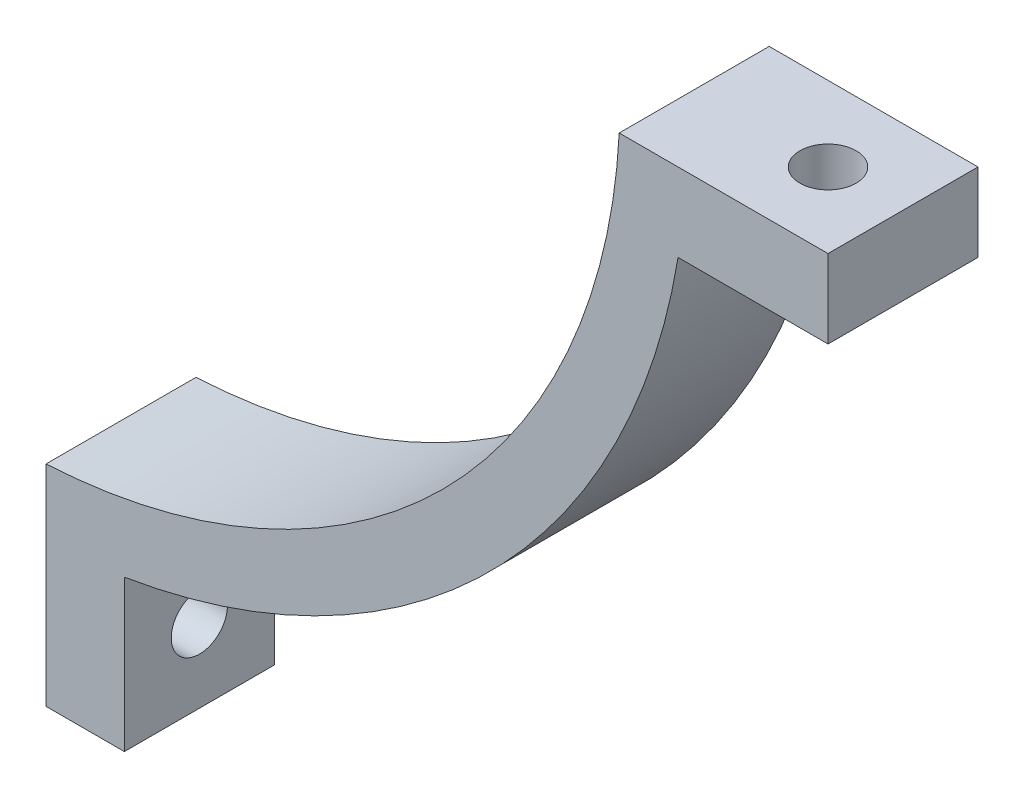
ISO-10303-21;
HEADER;
FILE_DESCRIPTION(('STEP AP214'),'2;1');
FILE_NAME('part.step','',(''),(''),'','','');
FILE_SCHEMA(('AUTOMOTIVE_DESIGN { 1 0 10303 214 1 1 1 1 }'));
ENDSEC;
DATA;
#1=APPLICATION_CONTEXT('core data for automotive mechanical design processes');
#2=APPLICATION_PROTOCOL_DEFINITION('international standard','automotive_design',2000,#1);
#3=PRODUCT_CONTEXT('',#1,'mechanical');
#4=PRODUCT('Part','Part','',(#3));
#5=PRODUCT_RELATED_PRODUCT_CATEGORY('part','',(#4));
#6=PRODUCT_DEFINITION_FORMATION('','',#4);
#7=PRODUCT_DEFINITION_CONTEXT('part definition',#1,'design');
#8=PRODUCT_DEFINITION('design','',#6,#7);
#9=PRODUCT_DEFINITION_SHAPE('','',#8);
#10=(LENGTH_UNIT() NAMED_UNIT(*) SI_UNIT(.MILLI.,.METRE.));
#11=(NAMED_UNIT(*) PLANE_ANGLE_UNIT() SI_UNIT($,.RADIAN.));
#12=(NAMED_UNIT(*) SI_UNIT($,.STERADIAN.) SOLID_ANGLE_UNIT());
#13=UNCERTAINTY_MEASURE_WITH_UNIT(LENGTH_MEASURE(1.E-05),#10,'distance_accuracy_value','');
#14=(GEOMETRIC_REPRESENTATION_CONTEXT(3) GLOBAL_UNCERTAINTY_ASSIGNED_CONTEXT((#13)) GLOBAL_UNIT_ASSIGNED_CONTEXT((#10,
#11,#12)) REPRESENTATION_CONTEXT('',''));
#15=CARTESIAN_POINT('',(0.,0.,0.));
#16=DIRECTION('',(0.,0.,1.));
#17=DIRECTION('',(1.,0.,0.));
#18=AXIS2_PLACEMENT_3D('',#15,#16,#17);
#19=CARTESIAN_POINT('',(0.,0.,12.7));
#20=DIRECTION('',(0.,0.,-1.));
#21=DIRECTION('',(-1.,0.,0.));
#22=AXIS2_PLACEMENT_3D('',#19,#20,#21);
#23=CYLINDRICAL_SURFACE('',#22,51.2439582188837);
#24=CARTESIAN_POINT('',(0.,0.,0.));
#25=DIRECTION('',(0.,0.,-1.));
#26=DIRECTION('',(-1.,0.,0.));
#27=AXIS2_PLACEMENT_3D('',#24,#25,#26);
#28=CIRCLE('',#27,51.2439582188837);
#29=CARTESIAN_POINT('',(51.1761537376169,-2.63525000000002,0.));
#30=VERTEX_POINT('',#29);
#31=CARTESIAN_POINT('',(2.63524999999997,-51.1761537376169,0.));
#32=VERTEX_POINT('',#31);
#33=EDGE_CURVE('E146',#30,#32,#28,.T.);
#34=ORIENTED_EDGE('',*,*,#33,.T.);
#35=DIRECTION('',(0.,0.,-1.));
#36=VECTOR('',#35,1.);
#37=CARTESIAN_POINT('',(2.63524999999997,-51.1761537376169,12.7));
#38=LINE('',#37,#36);
#39=CARTESIAN_POINT('',(2.63524999999997,-51.1761537376169,12.7));
#40=VERTEX_POINT('',#39);
#41=EDGE_CURVE('E11',#40,#32,#38,.T.);
#42=ORIENTED_EDGE('',*,*,#41,.F.);
#43=CARTESIAN_POINT('',(0.,0.,12.7));
#44=DIRECTION('',(0.,0.,-1.));
#45=DIRECTION('',(-1.,0.,0.));
#46=AXIS2_PLACEMENT_3D('',#43,#44,#45);
#47=CIRCLE('',#46,51.2439582188837);
#48=CARTESIAN_POINT('',(51.1761537376169,-2.63525000000002,12.7));
#49=VERTEX_POINT('',#48);
#50=EDGE_CURVE('E169',#49,#40,#47,.T.);
#51=ORIENTED_EDGE('',*,*,#50,.F.);
#52=DIRECTION('',(0.,0.,-1.));
#53=VECTOR('',#52,1.);
#54=CARTESIAN_POINT('',(51.1761537376169,-2.63525000000002,12.7));
#55=LINE('',#54,#53);
#56=EDGE_CURVE('E142',#49,#30,#55,.T.);
#57=ORIENTED_EDGE('',*,*,#56,.T.);
#58=EDGE_LOOP('',(#34,#42,#51,#57));
#59=FACE_BOUND('',#58,.T.);
#60=ADVANCED_FACE('F45',(#59),#23,.F.);
#61=CARTESIAN_POINT('',(2.63524999999997,-51.1761537376169,12.7));
#62=DIRECTION('',(1.,0.,0.));
#63=DIRECTION('',(0.,1.,0.));
#64=AXIS2_PLACEMENT_3D('',#61,#62,#63);
#65=PLANE('',#64);
#66=CARTESIAN_POINT('',(2.63524999999997,-62.6061537376169,6.35));
#67=DIRECTION('',(1.,0.,0.));
#68=DIRECTION('',(0.,0.,-1.));
#69=AXIS2_PLACEMENT_3D('',#66,#67,#68);
#70=CIRCLE('',#69,2.38125);
#71=CARTESIAN_POINT('',(2.63524999999997,-62.6061537376169,3.96875));
#72=VERTEX_POINT('',#71);
#73=EDGE_CURVE('E151',#72,#72,#70,.T.);
#74=ORIENTED_EDGE('',*,*,#73,.T.);
#75=EDGE_LOOP('',(#74));
#76=FACE_BOUND('',#75,.T.);
#77=DIRECTION('',(0.,-1.,0.));
#78=VECTOR('',#77,1.);
#79=CARTESIAN_POINT('',(2.63524999999997,-51.1761537376169,0.));
#80=LINE('',#79,#78);
#81=CARTESIAN_POINT('',(2.63524999999997,-68.9561537376169,0.));
#82=VERTEX_POINT('',#81);
#83=EDGE_CURVE('E150',#32,#82,#80,.T.);
#84=ORIENTED_EDGE('',*,*,#83,.T.);
#85=DIRECTION('',(0.,0.,-1.));
#86=VECTOR('',#85,1.);
#87=CARTESIAN_POINT('',(2.63524999999997,-68.9561537376169,12.7));
#88=LINE('',#87,#86);
#89=CARTESIAN_POINT('',(2.63524999999997,-68.9561537376169,12.7));
#90=VERTEX_POINT('',#89);
#91=EDGE_CURVE('E54',#90,#82,#88,.T.);
#92=ORIENTED_EDGE('',*,*,#91,.F.);
#93=DIRECTION('',(0.,-1.,0.));
#94=VECTOR('',#93,1.);
#95=CARTESIAN_POINT('',(2.63524999999997,-51.1761537376169,12.7));
#96=LINE('',#95,#94);
#97=EDGE_CURVE('E105',#40,#90,#96,.T.);
#98=ORIENTED_EDGE('',*,*,#97,.F.);
#99=ORIENTED_EDGE('',*,*,#41,.T.);
#100=EDGE_LOOP('',(#84,#92,#98,#99));
#101=FACE_BOUND('',#100,.T.);
#102=ADVANCED_FACE('F249',(#76,#101),#65,.F.);
#103=CARTESIAN_POINT('',(2.63524999999997,-68.9561537376169,12.7));
#104=DIRECTION('',(0.,1.,0.));
#105=DIRECTION('',(-1.,0.,0.));
#106=AXIS2_PLACEMENT_3D('',#103,#104,#105);
#107=PLANE('',#106);
#108=DIRECTION('',(1.,0.,0.));
#109=VECTOR('',#108,1.);
#110=CARTESIAN_POINT('',(2.63524999999997,-68.9561537376169,0.));
#111=LINE('',#110,#109);
#112=CARTESIAN_POINT('',(9.27099999999988,-68.9561537376169,0.));
#113=VERTEX_POINT('',#112);
#114=EDGE_CURVE('E154',#82,#113,#111,.T.);
#115=ORIENTED_EDGE('',*,*,#114,.T.);
#116=DIRECTION('',(0.,0.,-1.));
#117=VECTOR('',#116,1.);
#118=CARTESIAN_POINT('',(9.27099999999988,-68.9561537376169,12.7));
#119=LINE('',#118,#117);
#120=CARTESIAN_POINT('',(9.27099999999988,-68.9561537376169,12.7));
#121=VERTEX_POINT('',#120);
#122=EDGE_CURVE('E180',#121,#113,#119,.T.);
#123=ORIENTED_EDGE('',*,*,#122,.F.);
#124=DIRECTION('',(1.,0.,0.));
#125=VECTOR('',#124,1.);
#126=CARTESIAN_POINT('',(2.63524999999997,-68.9561537376169,12.7));
#127=LINE('',#126,#125);
#128=EDGE_CURVE('E190',#90,#121,#127,.T.);
#129=ORIENTED_EDGE('',*,*,#128,.F.);
#130=ORIENTED_EDGE('',*,*,#91,.T.);
#131=EDGE_LOOP('',(#115,#123,#129,#130));
#132=FACE_BOUND('',#131,.T.);
#133=ADVANCED_FACE('F188',(#132),#107,.F.);
#134=CARTESIAN_POINT('',(9.27099999999988,-68.9561537376169,12.7));
#135=DIRECTION('',(-1.,0.,0.));
#136=DIRECTION('',(0.,-1.,0.));
#137=AXIS2_PLACEMENT_3D('',#134,#135,#136);
#138=PLANE('',#137);
#139=CARTESIAN_POINT('',(9.27099999999987,-62.6061537376169,6.35));
#140=DIRECTION('',(1.,0.,0.));
#141=DIRECTION('',(0.,0.,-1.));
#142=AXIS2_PLACEMENT_3D('',#139,#140,#141);
#143=CIRCLE('',#142,2.38125);
#144=CARTESIAN_POINT('',(9.27099999999987,-62.6061537376169,3.96875));
#145=VERTEX_POINT('',#144);
#146=EDGE_CURVE('E213',#145,#145,#143,.T.);
#147=ORIENTED_EDGE('',*,*,#146,.F.);
#148=EDGE_LOOP('',(#147));
#149=FACE_BOUND('',#148,.T.);
#150=DIRECTION('',(0.,1.,0.));
#151=VECTOR('',#150,1.);
#152=CARTESIAN_POINT('',(9.27099999999988,-68.9561537376169,0.));
#153=LINE('',#152,#151);
#154=CARTESIAN_POINT('',(9.2709999999999,-56.1595459768018,0.));
#155=VERTEX_POINT('',#154);
#156=EDGE_CURVE('E157',#113,#155,#153,.T.);
#157=ORIENTED_EDGE('',*,*,#156,.T.);
#158=DIRECTION('',(0.,0.,-1.));
#159=VECTOR('',#158,1.);
#160=CARTESIAN_POINT('',(9.2709999999999,-56.1595459768018,12.7));
#161=LINE('',#160,#159);
#162=CARTESIAN_POINT('',(9.2709999999999,-56.1595459768018,12.7));
#163=VERTEX_POINT('',#162);
#164=EDGE_CURVE('E176',#163,#155,#161,.T.);
#165=ORIENTED_EDGE('',*,*,#164,.F.);
#166=DIRECTION('',(0.,1.,0.));
#167=VECTOR('',#166,1.);
#168=CARTESIAN_POINT('',(9.27099999999988,-68.9561537376169,12.7));
#169=LINE('',#168,#167);
#170=EDGE_CURVE('E203',#121,#163,#169,.T.);
#171=ORIENTED_EDGE('',*,*,#170,.F.);
#172=ORIENTED_EDGE('',*,*,#122,.T.);
#173=EDGE_LOOP('',(#157,#165,#171,#172));
#174=FACE_BOUND('',#173,.T.);
#175=ADVANCED_FACE('F198',(#149,#174),#138,.F.);
#176=CARTESIAN_POINT('',(0.,0.,12.7));
#177=DIRECTION('',(0.,0.,-1.));
#178=DIRECTION('',(-1.,0.,0.));
#179=AXIS2_PLACEMENT_3D('',#176,#177,#178);
#180=CYLINDRICAL_SURFACE('',#179,56.9196455129555);
#181=CARTESIAN_POINT('',(0.,0.,0.));
#182=DIRECTION('',(0.,0.,1.));
#183=DIRECTION('',(-1.,0.,0.));
#184=AXIS2_PLACEMENT_3D('',#181,#182,#183);
#185=CIRCLE('',#184,56.9196455129555);
#186=CARTESIAN_POINT('',(56.1595459768018,-9.27099999999999,0.));
#187=VERTEX_POINT('',#186);
#188=EDGE_CURVE('E160',#155,#187,#185,.T.);
#189=ORIENTED_EDGE('',*,*,#188,.T.);
#190=DIRECTION('',(0.,0.,-1.));
#191=VECTOR('',#190,1.);
#192=CARTESIAN_POINT('',(56.1595459768018,-9.27099999999999,12.7));
#193=LINE('',#192,#191);
#194=CARTESIAN_POINT('',(56.1595459768018,-9.27099999999999,12.7));
#195=VERTEX_POINT('',#194);
#196=EDGE_CURVE('E135',#195,#187,#193,.T.);
#197=ORIENTED_EDGE('',*,*,#196,.F.);
#198=CARTESIAN_POINT('',(0.,0.,12.7));
#199=DIRECTION('',(0.,0.,1.));
#200=DIRECTION('',(-1.,0.,0.));
#201=AXIS2_PLACEMENT_3D('',#198,#199,#200);
#202=CIRCLE('',#201,56.9196455129555);
#203=EDGE_CURVE('E124',#163,#195,#202,.T.);
#204=ORIENTED_EDGE('',*,*,#203,.F.);
#205=ORIENTED_EDGE('',*,*,#164,.T.);
#206=EDGE_LOOP('',(#189,#197,#204,#205));
#207=FACE_BOUND('',#206,.T.);
#208=ADVANCED_FACE('F201',(#207),#180,.T.);
#209=CARTESIAN_POINT('',(68.8595459768018,-9.27099999999999,12.7));
#210=DIRECTION('',(0.,1.,0.));
#211=DIRECTION('',(0.,0.,1.));
#212=AXIS2_PLACEMENT_3D('',#209,#210,#211);
#213=PLANE('',#212);
#214=CARTESIAN_POINT('',(62.5095459768018,-9.27099999999999,6.35));
#215=DIRECTION('',(0.,-1.,0.));
#216=DIRECTION('',(0.,0.,-1.));
#217=AXIS2_PLACEMENT_3D('',#214,#215,#216);
#218=CIRCLE('',#217,2.38125000000001);
#219=CARTESIAN_POINT('',(62.5095459768018,-9.27099999999999,3.96874999999999));
#220=VERTEX_POINT('',#219);
#221=EDGE_CURVE('E221',#220,#220,#218,.T.);
#222=ORIENTED_EDGE('',*,*,#221,.F.);
#223=EDGE_LOOP('',(#222));
#224=FACE_BOUND('',#223,.T.);
#225=DIRECTION('',(1.,0.,0.));
#226=VECTOR('',#225,1.);
#227=CARTESIAN_POINT('',(68.8595459768018,-9.27099999999999,0.));
#228=LINE('',#227,#226);
#229=CARTESIAN_POINT('',(68.8595459768018,-9.27099999999999,0.));
#230=VERTEX_POINT('',#229);
#231=EDGE_CURVE('E133',#187,#230,#228,.T.);
#232=ORIENTED_EDGE('',*,*,#231,.T.);
#233=DIRECTION('',(0.,0.,-1.));
#234=VECTOR('',#233,1.);
#235=CARTESIAN_POINT('',(68.8595459768018,-9.27099999999999,12.7));
#236=LINE('',#235,#234);
#237=CARTESIAN_POINT('',(68.8595459768018,-9.27099999999999,12.7));
#238=VERTEX_POINT('',#237);
#239=EDGE_CURVE('E130',#238,#230,#236,.T.);
#240=ORIENTED_EDGE('',*,*,#239,.F.);
#241=DIRECTION('',(1.,0.,0.));
#242=VECTOR('',#241,1.);
#243=CARTESIAN_POINT('',(68.8595459768018,-9.27099999999999,12.7));
#244=LINE('',#243,#242);
#245=EDGE_CURVE('E118',#195,#238,#244,.T.);
#246=ORIENTED_EDGE('',*,*,#245,.F.);
#247=ORIENTED_EDGE('',*,*,#196,.T.);
#248=EDGE_LOOP('',(#232,#240,#246,#247));
#249=FACE_BOUND('',#248,.T.);
#250=ADVANCED_FACE('F131',(#224,#249),#213,.F.);
#251=CARTESIAN_POINT('',(68.8595459768018,-2.63525000000002,12.7));
#252=DIRECTION('',(-1.,0.,0.));
#253=DIRECTION('',(0.,0.,1.));
#254=AXIS2_PLACEMENT_3D('',#251,#252,#253);
#255=PLANE('',#254);
#256=DIRECTION('',(0.,1.,0.));
#257=VECTOR('',#256,1.);
#258=CARTESIAN_POINT('',(68.8595459768018,-2.63525000000002,0.));
#259=LINE('',#258,#257);
#260=CARTESIAN_POINT('',(68.8595459768018,-2.63525000000002,0.));
#261=VERTEX_POINT('',#260);
#262=EDGE_CURVE('E91',#230,#261,#259,.T.);
#263=ORIENTED_EDGE('',*,*,#262,.T.);
#264=DIRECTION('',(0.,0.,-1.));
#265=VECTOR('',#264,1.);
#266=CARTESIAN_POINT('',(68.8595459768018,-2.63525000000002,12.7));
#267=LINE('',#266,#265);
#268=CARTESIAN_POINT('',(68.8595459768018,-2.63525000000002,12.7));
#269=VERTEX_POINT('',#268);
#270=EDGE_CURVE('E136',#269,#261,#267,.T.);
#271=ORIENTED_EDGE('',*,*,#270,.F.);
#272=DIRECTION('',(0.,1.,0.));
#273=VECTOR('',#272,1.);
#274=CARTESIAN_POINT('',(68.8595459768018,-2.63525000000002,12.7));
#275=LINE('',#274,#273);
#276=EDGE_CURVE('E122',#238,#269,#275,.T.);
#277=ORIENTED_EDGE('',*,*,#276,.F.);
#278=ORIENTED_EDGE('',*,*,#239,.T.);
#279=EDGE_LOOP('',(#263,#271,#277,#278));
#280=FACE_BOUND('',#279,.T.);
#281=ADVANCED_FACE('F138',(#280),#255,.F.);
#282=CARTESIAN_POINT('',(51.1761537376169,-2.63525000000002,12.7));
#283=DIRECTION('',(0.,-1.,0.));
#284=DIRECTION('',(1.,0.,0.));
#285=AXIS2_PLACEMENT_3D('',#282,#283,#284);
#286=PLANE('',#285);
#287=CARTESIAN_POINT('',(62.5095459768018,-2.63525000000002,6.35));
#288=DIRECTION('',(0.,-1.,0.));
#289=DIRECTION('',(0.,0.,-1.));
#290=AXIS2_PLACEMENT_3D('',#287,#288,#289);
#291=CIRCLE('',#290,2.38125000000001);
#292=CARTESIAN_POINT('',(62.5095459768018,-2.63525000000002,3.96874999999999));
#293=VERTEX_POINT('',#292);
#294=EDGE_CURVE('E217',#293,#293,#291,.T.);
#295=ORIENTED_EDGE('',*,*,#294,.T.);
#296=EDGE_LOOP('',(#295));
#297=FACE_BOUND('',#296,.T.);
#298=DIRECTION('',(-1.,0.,0.));
#299=VECTOR('',#298,1.);
#300=CARTESIAN_POINT('',(51.1761537376169,-2.63525000000002,0.));
#301=LINE('',#300,#299);
#302=EDGE_CURVE('E97',#261,#30,#301,.T.);
#303=ORIENTED_EDGE('',*,*,#302,.T.);
#304=ORIENTED_EDGE('',*,*,#56,.F.);
#305=DIRECTION('',(-1.,0.,0.));
#306=VECTOR('',#305,1.);
#307=CARTESIAN_POINT('',(51.1761537376169,-2.63525000000002,12.7));
#308=LINE('',#307,#306);
#309=EDGE_CURVE('E62',#269,#49,#308,.T.);
#310=ORIENTED_EDGE('',*,*,#309,.F.);
#311=ORIENTED_EDGE('',*,*,#270,.T.);
#312=EDGE_LOOP('',(#303,#304,#310,#311));
#313=FACE_BOUND('',#312,.T.);
#314=ADVANCED_FACE('F229',(#297,#313),#286,.F.);
#315=CARTESIAN_POINT('',(0.,0.,12.7));
#316=DIRECTION('',(0.,0.,-1.));
#317=DIRECTION('',(-1.,0.,0.));
#318=AXIS2_PLACEMENT_3D('',#315,#316,#317);
#319=PLANE('',#318);
#320=ORIENTED_EDGE('',*,*,#50,.T.);
#321=ORIENTED_EDGE('',*,*,#97,.T.);
#322=ORIENTED_EDGE('',*,*,#128,.T.);
#323=ORIENTED_EDGE('',*,*,#170,.T.);
#324=ORIENTED_EDGE('',*,*,#203,.T.);
#325=ORIENTED_EDGE('',*,*,#245,.T.);
#326=ORIENTED_EDGE('',*,*,#276,.T.);
#327=ORIENTED_EDGE('',*,*,#309,.T.);
#328=EDGE_LOOP('',(#320,#321,#322,#323,#324,#325,#326,#327));
#329=FACE_BOUND('',#328,.T.);
#330=ADVANCED_FACE('F120',(#329),#319,.F.);
#331=CARTESIAN_POINT('',(0.,0.,0.));
#332=DIRECTION('',(0.,0.,-1.));
#333=DIRECTION('',(-1.,0.,0.));
#334=AXIS2_PLACEMENT_3D('',#331,#332,#333);
#335=PLANE('',#334);
#336=ORIENTED_EDGE('',*,*,#33,.F.);
#337=ORIENTED_EDGE('',*,*,#302,.F.);
#338=ORIENTED_EDGE('',*,*,#262,.F.);
#339=ORIENTED_EDGE('',*,*,#231,.F.);
#340=ORIENTED_EDGE('',*,*,#188,.F.);
#341=ORIENTED_EDGE('',*,*,#156,.F.);
#342=ORIENTED_EDGE('',*,*,#114,.F.);
#343=ORIENTED_EDGE('',*,*,#83,.F.);
#344=EDGE_LOOP('',(#336,#337,#338,#339,#340,#341,#342,#343));
#345=FACE_BOUND('',#344,.T.);
#346=ADVANCED_FACE('F194',(#345),#335,.T.);
#347=CARTESIAN_POINT('',(2.63524999999997,-62.6061537376169,6.35));
#348=DIRECTION('',(1.,0.,0.));
#349=DIRECTION('',(0.,0.,-1.));
#350=AXIS2_PLACEMENT_3D('',#347,#348,#349);
#351=CYLINDRICAL_SURFACE('',#350,2.38125);
#352=ORIENTED_EDGE('',*,*,#73,.F.);
#353=EDGE_LOOP('',(#352));
#354=FACE_BOUND('',#353,.T.);
#355=ORIENTED_EDGE('',*,*,#146,.T.);
#356=EDGE_LOOP('',(#355));
#357=FACE_BOUND('',#356,.T.);
#358=ADVANCED_FACE('F234',(#354,#357),#351,.F.);
#359=CARTESIAN_POINT('',(62.5095459768018,-2.63525000000002,6.35));
#360=DIRECTION('',(0.,-1.,0.));
#361=DIRECTION('',(0.,0.,-1.));
#362=AXIS2_PLACEMENT_3D('',#359,#360,#361);
#363=CYLINDRICAL_SURFACE('',#362,2.38125000000001);
#364=ORIENTED_EDGE('',*,*,#294,.F.);
#365=EDGE_LOOP('',(#364));
#366=FACE_BOUND('',#365,.T.);
#367=ORIENTED_EDGE('',*,*,#221,.T.);
#368=EDGE_LOOP('',(#367));
#369=FACE_BOUND('',#368,.T.);
#370=ADVANCED_FACE('F231',(#366,#369),#363,.F.);
#371=CLOSED_SHELL('',(#60,#102,#133,#175,#208,#250,#281,#314,#330,#346,#358,#370));
#372=MANIFOLD_SOLID_BREP('B2',#371);
#373=ADVANCED_BREP_SHAPE_REPRESENTATION('',(#18,#372),#14);
#374=SHAPE_DEFINITION_REPRESENTATION(#9,#373);
ENDSEC;
END-ISO-10303-21;
